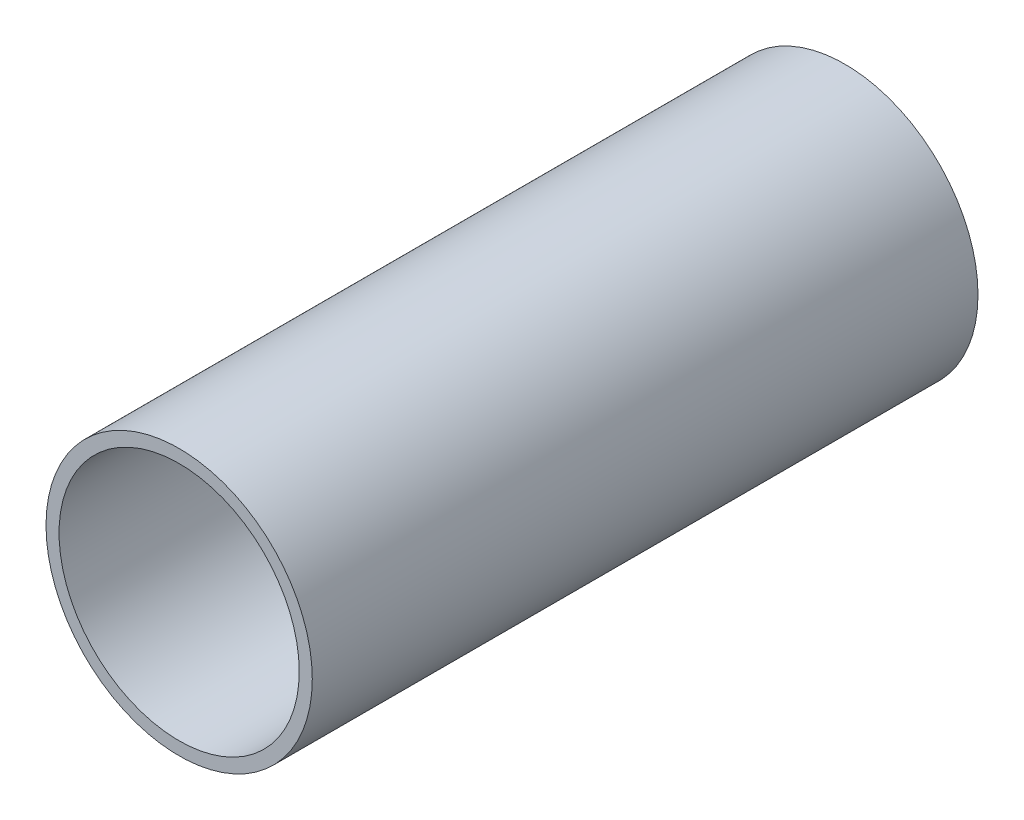
ISO-10303-21;
HEADER;
FILE_DESCRIPTION(('STEP AP214'),'2;1');
FILE_NAME('part.step','',(''),(''),'','','');
FILE_SCHEMA(('AUTOMOTIVE_DESIGN { 1 0 10303 214 1 1 1 1 }'));
ENDSEC;
DATA;
#1=APPLICATION_CONTEXT('core data for automotive mechanical design processes');
#2=APPLICATION_PROTOCOL_DEFINITION('international standard','automotive_design',2000,#1);
#3=PRODUCT_CONTEXT('',#1,'mechanical');
#4=PRODUCT('Part','Part','',(#3));
#5=PRODUCT_RELATED_PRODUCT_CATEGORY('part','',(#4));
#6=PRODUCT_DEFINITION_FORMATION('','',#4);
#7=PRODUCT_DEFINITION_CONTEXT('part definition',#1,'design');
#8=PRODUCT_DEFINITION('design','',#6,#7);
#9=PRODUCT_DEFINITION_SHAPE('','',#8);
#10=(LENGTH_UNIT() NAMED_UNIT(*) SI_UNIT(.MILLI.,.METRE.));
#11=(NAMED_UNIT(*) PLANE_ANGLE_UNIT() SI_UNIT($,.RADIAN.));
#12=(NAMED_UNIT(*) SI_UNIT($,.STERADIAN.) SOLID_ANGLE_UNIT());
#13=UNCERTAINTY_MEASURE_WITH_UNIT(LENGTH_MEASURE(1.E-05),#10,'distance_accuracy_value','');
#14=(GEOMETRIC_REPRESENTATION_CONTEXT(3) GLOBAL_UNCERTAINTY_ASSIGNED_CONTEXT((#13)) GLOBAL_UNIT_ASSIGNED_CONTEXT((#10,
#11,#12)) REPRESENTATION_CONTEXT('',''));
#15=CARTESIAN_POINT('',(0.,0.,0.));
#16=DIRECTION('',(0.,0.,1.));
#17=DIRECTION('',(1.,0.,0.));
#18=AXIS2_PLACEMENT_3D('',#15,#16,#17);
#19=CARTESIAN_POINT('',(0.,0.,63.5));
#20=DIRECTION('',(0.,0.,1.));
#21=DIRECTION('',(1.,0.,0.));
#22=AXIS2_PLACEMENT_3D('',#19,#20,#21);
#23=PLANE('',#22);
#24=CARTESIAN_POINT('',(0.,0.,63.5));
#25=DIRECTION('',(0.,0.,1.));
#26=DIRECTION('',(1.,0.,0.));
#27=AXIS2_PLACEMENT_3D('',#24,#25,#26);
#28=CIRCLE('',#27,12.7);
#29=CARTESIAN_POINT('',(12.7,0.,63.5));
#30=VERTEX_POINT('',#29);
#31=EDGE_CURVE('E10',#30,#30,#28,.T.);
#32=ORIENTED_EDGE('',*,*,#31,.T.);
#33=EDGE_LOOP('',(#32));
#34=FACE_BOUND('',#33,.T.);
#35=CARTESIAN_POINT('',(0.,0.,63.5));
#36=DIRECTION('',(0.,0.,1.));
#37=DIRECTION('',(1.,0.,0.));
#38=AXIS2_PLACEMENT_3D('',#35,#36,#37);
#39=CIRCLE('',#38,11.4554);
#40=CARTESIAN_POINT('',(11.4554,0.,63.5));
#41=VERTEX_POINT('',#40);
#42=EDGE_CURVE('E42',#41,#41,#39,.T.);
#43=ORIENTED_EDGE('',*,*,#42,.F.);
#44=EDGE_LOOP('',(#43));
#45=FACE_BOUND('',#44,.T.);
#46=ADVANCED_FACE('F31',(#34,#45),#23,.T.);
#47=CARTESIAN_POINT('',(0.,0.,0.));
#48=DIRECTION('',(0.,0.,1.));
#49=DIRECTION('',(1.,0.,0.));
#50=AXIS2_PLACEMENT_3D('',#47,#48,#49);
#51=PLANE('',#50);
#52=CARTESIAN_POINT('',(0.,0.,0.));
#53=DIRECTION('',(0.,0.,1.));
#54=DIRECTION('',(1.,0.,0.));
#55=AXIS2_PLACEMENT_3D('',#52,#53,#54);
#56=CIRCLE('',#55,12.7);
#57=CARTESIAN_POINT('',(12.7,0.,0.));
#58=VERTEX_POINT('',#57);
#59=EDGE_CURVE('E35',#58,#58,#56,.T.);
#60=ORIENTED_EDGE('',*,*,#59,.F.);
#61=EDGE_LOOP('',(#60));
#62=FACE_BOUND('',#61,.T.);
#63=CARTESIAN_POINT('',(0.,0.,0.));
#64=DIRECTION('',(0.,0.,1.));
#65=DIRECTION('',(1.,0.,0.));
#66=AXIS2_PLACEMENT_3D('',#63,#64,#65);
#67=CIRCLE('',#66,11.4554);
#68=CARTESIAN_POINT('',(11.4554,0.,0.));
#69=VERTEX_POINT('',#68);
#70=EDGE_CURVE('E44',#69,#69,#67,.T.);
#71=ORIENTED_EDGE('',*,*,#70,.T.);
#72=EDGE_LOOP('',(#71));
#73=FACE_BOUND('',#72,.T.);
#74=ADVANCED_FACE('F54',(#62,#73),#51,.F.);
#75=CARTESIAN_POINT('',(0.,0.,63.5));
#76=DIRECTION('',(0.,0.,-1.));
#77=DIRECTION('',(-1.,0.,0.));
#78=AXIS2_PLACEMENT_3D('',#75,#76,#77);
#79=CYLINDRICAL_SURFACE('',#78,12.7);
#80=ORIENTED_EDGE('',*,*,#31,.F.);
#81=EDGE_LOOP('',(#80));
#82=FACE_BOUND('',#81,.T.);
#83=ORIENTED_EDGE('',*,*,#59,.T.);
#84=EDGE_LOOP('',(#83));
#85=FACE_BOUND('',#84,.T.);
#86=ADVANCED_FACE('F33',(#82,#85),#79,.T.);
#87=CARTESIAN_POINT('',(0.,0.,63.5));
#88=DIRECTION('',(0.,0.,-1.));
#89=DIRECTION('',(-1.,0.,0.));
#90=AXIS2_PLACEMENT_3D('',#87,#88,#89);
#91=CYLINDRICAL_SURFACE('',#90,11.4554);
#92=ORIENTED_EDGE('',*,*,#42,.T.);
#93=EDGE_LOOP('',(#92));
#94=FACE_BOUND('',#93,.T.);
#95=ORIENTED_EDGE('',*,*,#70,.F.);
#96=EDGE_LOOP('',(#95));
#97=FACE_BOUND('',#96,.T.);
#98=ADVANCED_FACE('F50',(#94,#97),#91,.F.);
#99=CLOSED_SHELL('',(#46,#74,#86,#98));
#100=MANIFOLD_SOLID_BREP('B2',#99);
#101=ADVANCED_BREP_SHAPE_REPRESENTATION('',(#18,#100),#14);
#102=SHAPE_DEFINITION_REPRESENTATION(#9,#101);
ENDSEC;
END-ISO-10303-21;
